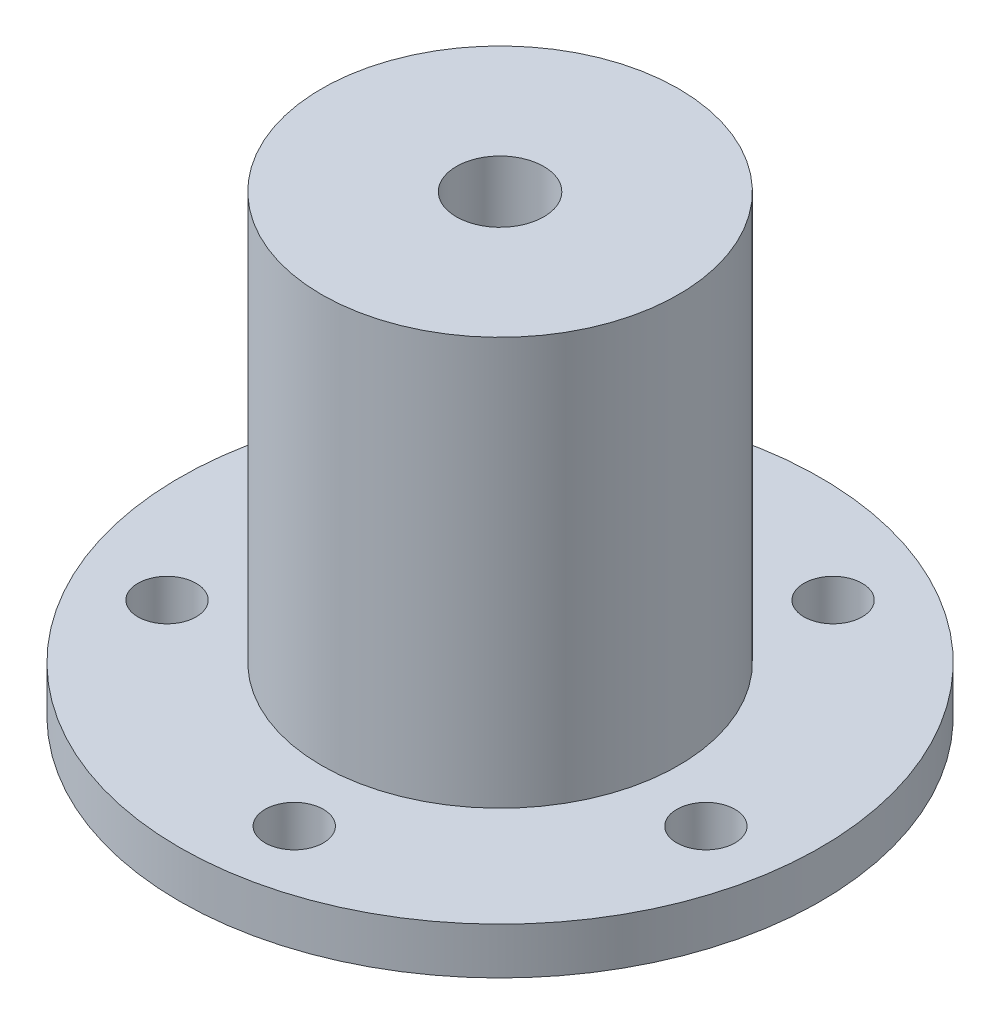
ISO-10303-21;
HEADER;
FILE_DESCRIPTION(('STEP AP214'),'2;1');
FILE_NAME('part.step','',(''),(''),'','','');
FILE_SCHEMA(('AUTOMOTIVE_DESIGN { 1 0 10303 214 1 1 1 1 }'));
ENDSEC;
DATA;
#1=APPLICATION_CONTEXT('core data for automotive mechanical design processes');
#2=APPLICATION_PROTOCOL_DEFINITION('international standard','automotive_design',2000,#1);
#3=PRODUCT_CONTEXT('',#1,'mechanical');
#4=PRODUCT('Part','Part','',(#3));
#5=PRODUCT_RELATED_PRODUCT_CATEGORY('part','',(#4));
#6=PRODUCT_DEFINITION_FORMATION('','',#4);
#7=PRODUCT_DEFINITION_CONTEXT('part definition',#1,'design');
#8=PRODUCT_DEFINITION('design','',#6,#7);
#9=PRODUCT_DEFINITION_SHAPE('','',#8);
#10=(LENGTH_UNIT() NAMED_UNIT(*) SI_UNIT(.MILLI.,.METRE.));
#11=(NAMED_UNIT(*) PLANE_ANGLE_UNIT() SI_UNIT($,.RADIAN.));
#12=(NAMED_UNIT(*) SI_UNIT($,.STERADIAN.) SOLID_ANGLE_UNIT());
#13=UNCERTAINTY_MEASURE_WITH_UNIT(LENGTH_MEASURE(1.E-05),#10,'distance_accuracy_value','');
#14=(GEOMETRIC_REPRESENTATION_CONTEXT(3) GLOBAL_UNCERTAINTY_ASSIGNED_CONTEXT((#13)) GLOBAL_UNIT_ASSIGNED_CONTEXT((#10,
#11,#12)) REPRESENTATION_CONTEXT('',''));
#15=CARTESIAN_POINT('',(0.,0.,0.));
#16=DIRECTION('',(0.,0.,1.));
#17=DIRECTION('',(1.,0.,0.));
#18=AXIS2_PLACEMENT_3D('',#15,#16,#17);
#19=CARTESIAN_POINT('',(0.,1.6,0.));
#20=DIRECTION('',(0.,-1.,0.));
#21=DIRECTION('',(0.,0.,-1.));
#22=AXIS2_PLACEMENT_3D('',#19,#20,#21);
#23=CYLINDRICAL_SURFACE('',#22,11.);
#24=CARTESIAN_POINT('',(0.,1.6,0.));
#25=DIRECTION('',(0.,1.,0.));
#26=DIRECTION('',(0.,0.,1.));
#27=AXIS2_PLACEMENT_3D('',#24,#25,#26);
#28=CIRCLE('',#27,11.);
#29=CARTESIAN_POINT('',(0.,1.6,11.));
#30=VERTEX_POINT('',#29);
#31=EDGE_CURVE('E82',#30,#30,#28,.T.);
#32=ORIENTED_EDGE('',*,*,#31,.F.);
#33=EDGE_LOOP('',(#32));
#34=FACE_BOUND('',#33,.T.);
#35=CARTESIAN_POINT('',(0.,0.,0.));
#36=DIRECTION('',(0.,1.,0.));
#37=DIRECTION('',(0.,0.,1.));
#38=AXIS2_PLACEMENT_3D('',#35,#36,#37);
#39=CIRCLE('',#38,11.);
#40=CARTESIAN_POINT('',(0.,0.,11.));
#41=VERTEX_POINT('',#40);
#42=EDGE_CURVE('E79',#41,#41,#39,.T.);
#43=ORIENTED_EDGE('',*,*,#42,.T.);
#44=EDGE_LOOP('',(#43));
#45=FACE_BOUND('',#44,.T.);
#46=ADVANCED_FACE('F38',(#34,#45),#23,.T.);
#47=CARTESIAN_POINT('',(0.,1.6,0.));
#48=DIRECTION('',(0.,1.,0.));
#49=DIRECTION('',(0.,0.,1.));
#50=AXIS2_PLACEMENT_3D('',#47,#48,#49);
#51=PLANE('',#50);
#52=CARTESIAN_POINT('',(3.85891924778608,1.6,-7.57355545560116));
#53=DIRECTION('',(0.,1.,0.));
#54=DIRECTION('',(0.,0.,1.));
#55=AXIS2_PLACEMENT_3D('',#52,#53,#54);
#56=CIRCLE('',#55,1.);
#57=CARTESIAN_POINT('',(3.85891924778608,1.6,-6.57355545560116));
#58=VERTEX_POINT('',#57);
#59=EDGE_CURVE('E230',#58,#58,#56,.F.);
#60=ORIENTED_EDGE('',*,*,#59,.T.);
#61=EDGE_LOOP('',(#60));
#62=FACE_BOUND('',#61,.T.);
#63=CARTESIAN_POINT('',(8.39535089505868,1.6,1.32969295284189));
#64=DIRECTION('',(0.,1.,0.));
#65=DIRECTION('',(0.,0.,1.));
#66=AXIS2_PLACEMENT_3D('',#63,#64,#65);
#67=CIRCLE('',#66,1.);
#68=CARTESIAN_POINT('',(8.39535089505868,1.6,2.32969295284189));
#69=VERTEX_POINT('',#68);
#70=EDGE_CURVE('E224',#69,#69,#67,.F.);
#71=ORIENTED_EDGE('',*,*,#70,.T.);
#72=EDGE_LOOP('',(#71));
#73=FACE_BOUND('',#72,.T.);
#74=CARTESIAN_POINT('',(1.32969295284204,1.6,8.39535089505866));
#75=DIRECTION('',(0.,1.,0.));
#76=DIRECTION('',(0.,0.,1.));
#77=AXIS2_PLACEMENT_3D('',#74,#75,#76);
#78=CIRCLE('',#77,1.);
#79=CARTESIAN_POINT('',(1.32969295284204,1.6,9.39535089505866));
#80=VERTEX_POINT('',#79);
#81=EDGE_CURVE('E218',#80,#80,#78,.F.);
#82=ORIENTED_EDGE('',*,*,#81,.T.);
#83=EDGE_LOOP('',(#82));
#84=FACE_BOUND('',#83,.T.);
#85=CARTESIAN_POINT('',(-7.57355545560109,1.6,3.85891924778622));
#86=DIRECTION('',(0.,1.,0.));
#87=DIRECTION('',(0.,0.,1.));
#88=AXIS2_PLACEMENT_3D('',#85,#86,#87);
#89=CIRCLE('',#88,1.);
#90=CARTESIAN_POINT('',(-7.57355545560109,1.6,4.85891924778622));
#91=VERTEX_POINT('',#90);
#92=EDGE_CURVE('E217',#91,#91,#89,.F.);
#93=ORIENTED_EDGE('',*,*,#92,.T.);
#94=EDGE_LOOP('',(#93));
#95=FACE_BOUND('',#94,.T.);
#96=CARTESIAN_POINT('',(-6.01040764008571,1.6,-6.0104076400856));
#97=DIRECTION('',(0.,1.,0.));
#98=DIRECTION('',(0.,0.,1.));
#99=AXIS2_PLACEMENT_3D('',#96,#97,#98);
#100=CIRCLE('',#99,1.);
#101=CARTESIAN_POINT('',(-6.01040764008571,1.6,-5.0104076400856));
#102=VERTEX_POINT('',#101);
#103=EDGE_CURVE('E69',#102,#102,#100,.F.);
#104=ORIENTED_EDGE('',*,*,#103,.T.);
#105=EDGE_LOOP('',(#104));
#106=FACE_BOUND('',#105,.T.);
#107=CARTESIAN_POINT('',(0.,1.6,0.));
#108=DIRECTION('',(0.,1.,0.));
#109=DIRECTION('',(0.,0.,1.));
#110=AXIS2_PLACEMENT_3D('',#107,#108,#109);
#111=CIRCLE('',#110,6.125);
#112=CARTESIAN_POINT('',(0.,1.6,6.125));
#113=VERTEX_POINT('',#112);
#114=EDGE_CURVE('E54',#113,#113,#111,.T.);
#115=ORIENTED_EDGE('',*,*,#114,.F.);
#116=EDGE_LOOP('',(#115));
#117=FACE_BOUND('',#116,.T.);
#118=ORIENTED_EDGE('',*,*,#31,.T.);
#119=EDGE_LOOP('',(#118));
#120=FACE_BOUND('',#119,.T.);
#121=ADVANCED_FACE('F92',(#62,#73,#84,#95,#106,#117,#120),#51,.T.);
#122=CARTESIAN_POINT('',(0.,0.,0.));
#123=DIRECTION('',(0.,1.,0.));
#124=DIRECTION('',(0.,0.,1.));
#125=AXIS2_PLACEMENT_3D('',#122,#123,#124);
#126=PLANE('',#125);
#127=CARTESIAN_POINT('',(3.85891924778608,0.,-7.57355545560116));
#128=DIRECTION('',(0.,-1.,0.));
#129=DIRECTION('',(0.,0.,-1.));
#130=AXIS2_PLACEMENT_3D('',#127,#128,#129);
#131=CIRCLE('',#130,1.);
#132=CARTESIAN_POINT('',(3.85891924778608,0.,-8.57355545560116));
#133=VERTEX_POINT('',#132);
#134=EDGE_CURVE('E204',#133,#133,#131,.T.);
#135=ORIENTED_EDGE('',*,*,#134,.F.);
#136=EDGE_LOOP('',(#135));
#137=FACE_BOUND('',#136,.T.);
#138=CARTESIAN_POINT('',(8.39535089505868,0.,1.32969295284189));
#139=DIRECTION('',(0.,-1.,0.));
#140=DIRECTION('',(0.,0.,-1.));
#141=AXIS2_PLACEMENT_3D('',#138,#139,#140);
#142=CIRCLE('',#141,1.);
#143=CARTESIAN_POINT('',(8.39535089505868,0.,0.329692952841886));
#144=VERTEX_POINT('',#143);
#145=EDGE_CURVE('E227',#144,#144,#142,.T.);
#146=ORIENTED_EDGE('',*,*,#145,.F.);
#147=EDGE_LOOP('',(#146));
#148=FACE_BOUND('',#147,.T.);
#149=CARTESIAN_POINT('',(1.32969295284204,0.,8.39535089505866));
#150=DIRECTION('',(0.,-1.,0.));
#151=DIRECTION('',(0.,0.,-1.));
#152=AXIS2_PLACEMENT_3D('',#149,#150,#151);
#153=CIRCLE('',#152,1.);
#154=CARTESIAN_POINT('',(1.32969295284204,0.,7.39535089505866));
#155=VERTEX_POINT('',#154);
#156=EDGE_CURVE('E221',#155,#155,#153,.T.);
#157=ORIENTED_EDGE('',*,*,#156,.F.);
#158=EDGE_LOOP('',(#157));
#159=FACE_BOUND('',#158,.T.);
#160=CARTESIAN_POINT('',(-7.57355545560109,0.,3.85891924778622));
#161=DIRECTION('',(0.,-1.,0.));
#162=DIRECTION('',(0.,0.,-1.));
#163=AXIS2_PLACEMENT_3D('',#160,#161,#162);
#164=CIRCLE('',#163,1.);
#165=CARTESIAN_POINT('',(-7.57355545560109,0.,2.85891924778622));
#166=VERTEX_POINT('',#165);
#167=EDGE_CURVE('E205',#166,#166,#164,.T.);
#168=ORIENTED_EDGE('',*,*,#167,.F.);
#169=EDGE_LOOP('',(#168));
#170=FACE_BOUND('',#169,.T.);
#171=CARTESIAN_POINT('',(-6.01040764008571,0.,-6.0104076400856));
#172=DIRECTION('',(0.,-1.,0.));
#173=DIRECTION('',(0.,0.,-1.));
#174=AXIS2_PLACEMENT_3D('',#171,#172,#173);
#175=CIRCLE('',#174,1.);
#176=CARTESIAN_POINT('',(-6.01040764008571,0.,-7.0104076400856));
#177=VERTEX_POINT('',#176);
#178=EDGE_CURVE('E74',#177,#177,#175,.T.);
#179=ORIENTED_EDGE('',*,*,#178,.F.);
#180=EDGE_LOOP('',(#179));
#181=FACE_BOUND('',#180,.T.);
#182=CARTESIAN_POINT('',(0.,0.,0.));
#183=DIRECTION('',(0.,1.,0.));
#184=DIRECTION('',(0.,0.,1.));
#185=AXIS2_PLACEMENT_3D('',#182,#183,#184);
#186=CIRCLE('',#185,1.5);
#187=CARTESIAN_POINT('',(0.,0.,1.5));
#188=VERTEX_POINT('',#187);
#189=EDGE_CURVE('E64',#188,#188,#186,.T.);
#190=ORIENTED_EDGE('',*,*,#189,.T.);
#191=EDGE_LOOP('',(#190));
#192=FACE_BOUND('',#191,.T.);
#193=ORIENTED_EDGE('',*,*,#42,.F.);
#194=EDGE_LOOP('',(#193));
#195=FACE_BOUND('',#194,.T.);
#196=ADVANCED_FACE('F89',(#137,#148,#159,#170,#181,#192,#195),#126,.F.);
#197=CARTESIAN_POINT('',(0.,15.6,0.));
#198=DIRECTION('',(0.,-1.,0.));
#199=DIRECTION('',(0.,0.,-1.));
#200=AXIS2_PLACEMENT_3D('',#197,#198,#199);
#201=CYLINDRICAL_SURFACE('',#200,6.125);
#202=CARTESIAN_POINT('',(0.,12.1,-6.125));
#203=CARTESIAN_POINT('',(-0.0829306005824024,12.0999975764613,-6.12499856396247));
#204=CARTESIAN_POINT('',(-0.165888626107481,12.0930993615078,-6.12329887898551));
#205=CARTESIAN_POINT('',(-0.329430714252231,12.0657278993208,-6.11668309677731));
#206=CARTESIAN_POINT('',(-0.410013341825552,12.045246614867,-6.1117650952631));
#207=CARTESIAN_POINT('',(-0.566419015525031,11.9914027926989,-6.09925778784529));
#208=CARTESIAN_POINT('',(-0.642247530418136,11.9580553834099,-6.09167162018446));
#209=CARTESIAN_POINT('',(-0.787233558664146,11.8794782781923,-6.07463775516129));
#210=CARTESIAN_POINT('',(-0.85639091333032,11.8342482997086,-6.06519001353398));
#211=CARTESIAN_POINT('',(-0.987442801407419,11.7322426390357,-6.04525088671361));
#212=CARTESIAN_POINT('',(-1.04918624015421,11.6752758714347,-6.0347439250254));
#213=CARTESIAN_POINT('',(-1.16234492716674,11.5518230151991,-6.01397508985644));
#214=CARTESIAN_POINT('',(-1.21375905443416,11.4853358946988,-6.00371324308339));
#215=CARTESIAN_POINT('',(-1.30550267891219,11.3435660914855,-5.9844401162813));
#216=CARTESIAN_POINT('',(-1.34566456100555,11.2681720029365,-5.97544864459751));
#217=CARTESIAN_POINT('',(-1.4126862213248,11.111446987456,-5.95996089889054));
#218=CARTESIAN_POINT('',(-1.43954803211376,11.030116969855,-5.95346424363494));
#219=CARTESIAN_POINT('',(-1.47869433779495,10.8654865027247,-5.94386156797189));
#220=CARTESIAN_POINT('',(-1.49124981321253,10.782254242901,-5.94069261078362));
#221=CARTESIAN_POINT('',(-1.50227086513698,10.6148090692434,-5.93791564028692));
#222=CARTESIAN_POINT('',(-1.50073863575971,10.5305963101595,-5.93830707245891));
#223=CARTESIAN_POINT('',(-1.48384429410747,10.3656465344104,-5.9425500091736));
#224=CARTESIAN_POINT('',(-1.46880366084462,10.2848742010339,-5.94632107914021));
#225=CARTESIAN_POINT('',(-1.42583168565202,10.1270355687205,-5.95677037744899));
#226=CARTESIAN_POINT('',(-1.39789945852544,10.0499695246759,-5.9634488054221));
#227=CARTESIAN_POINT('',(-1.32965963627587,9.90086193757087,-5.97903508081306));
#228=CARTESIAN_POINT('',(-1.28923418805927,9.82887662594933,-5.98796400333177));
#229=CARTESIAN_POINT('',(-1.19723794707047,9.69259535163802,-6.00703313387521));
#230=CARTESIAN_POINT('',(-1.14566527682664,9.62830068708312,-6.0171735458163));
#231=CARTESIAN_POINT('',(-1.03116703829527,9.50738198315466,-6.03786287547061));
#232=CARTESIAN_POINT('',(-0.967969810710724,9.45101548194737,-6.04841538508906));
#233=CARTESIAN_POINT('',(-0.832894308059626,9.34963285026216,-6.06848968290004));
#234=CARTESIAN_POINT('',(-0.761015788564495,9.30461703948205,-6.07801144205666));
#235=CARTESIAN_POINT('',(-0.610259770448615,9.22712446428253,-6.09499571936318));
#236=CARTESIAN_POINT('',(-0.531360686635111,9.19468813768492,-6.10245157491609));
#237=CARTESIAN_POINT('',(-0.369006832957924,9.14360986336245,-6.11441538573556));
#238=CARTESIAN_POINT('',(-0.285552901353999,9.12496538655956,-6.11892388145608));
#239=CARTESIAN_POINT('',(-0.118661422947513,9.10239014386932,-6.12440553014033));
#240=CARTESIAN_POINT('',(-0.0352740408282093,9.09810848516009,-6.1254629766344));
#241=CARTESIAN_POINT('',(0.131025466072572,9.10341996007035,-6.12416279988687));
#242=CARTESIAN_POINT('',(0.21393763117905,9.11301189839418,-6.12180547084915));
#243=CARTESIAN_POINT('',(0.375723525677185,9.14550870463527,-6.11399449797241));
#244=CARTESIAN_POINT('',(0.454637781212646,9.16822340921458,-6.10858510751231));
#245=CARTESIAN_POINT('',(0.607532568804245,9.22610480885644,-6.09527879494356));
#246=CARTESIAN_POINT('',(0.681512613687506,9.26127273131487,-6.08738162764675));
#247=CARTESIAN_POINT('',(0.823844536204184,9.34375100156103,-6.06977270746887));
#248=CARTESIAN_POINT('',(0.892077915590571,9.39125953743443,-6.0600321163636));
#249=CARTESIAN_POINT('',(1.01972870259778,9.49681584109431,-6.0398643897347));
#250=CARTESIAN_POINT('',(1.07914465062184,9.55486535025611,-6.02943714095647));
#251=CARTESIAN_POINT('',(1.18891012127041,9.68148211906465,-6.00876993226737));
#252=CARTESIAN_POINT('',(1.23901398493305,9.7502643470879,-5.99854011984379));
#253=CARTESIAN_POINT('',(1.32696627492766,9.89546884630378,-5.97970037322189));
#254=CARTESIAN_POINT('',(1.36481524892507,9.9718907758818,-5.97109036664238));
#255=CARTESIAN_POINT('',(1.42690428657667,10.1297912761734,-5.9565582695881));
#256=CARTESIAN_POINT('',(1.45122492211072,10.2112366282115,-5.9506203063713));
#257=CARTESIAN_POINT('',(1.48578428107045,10.3772268301115,-5.94208657507043));
#258=CARTESIAN_POINT('',(1.49602593664092,10.461771030828,-5.93949011107953));
#259=CARTESIAN_POINT('',(1.50198811424395,10.6290634108868,-5.93798486677975));
#260=CARTESIAN_POINT('',(1.49810067995139,10.7117969505765,-5.9389765224894));
#261=CARTESIAN_POINT('',(1.47680871156497,10.8753904876045,-5.94430644710493));
#262=CARTESIAN_POINT('',(1.45940442818799,10.9562505196651,-5.9486446539374));
#263=CARTESIAN_POINT('',(1.41178287902866,11.1133951720956,-5.96012453242491));
#264=CARTESIAN_POINT('',(1.38163633029805,11.1897024315756,-5.96725071536384));
#265=CARTESIAN_POINT('',(1.30944246656108,11.3362292822357,-5.98350637003248));
#266=CARTESIAN_POINT('',(1.26739356784856,11.4064480616678,-5.99263610831544));
#267=CARTESIAN_POINT('',(1.1713473780251,11.5407058446536,-6.01215642384141));
#268=CARTESIAN_POINT('',(1.11707676430904,11.6045455868815,-6.02257288890672));
#269=CARTESIAN_POINT('',(0.998664056170338,11.722339642997,-6.04333531467797));
#270=CARTESIAN_POINT('',(0.934519634758436,11.7762916200229,-6.0536812581621));
#271=CARTESIAN_POINT('',(0.796849803860762,11.873680201329,-6.07334892532539));
#272=CARTESIAN_POINT('',(0.723182127344935,11.9169201687889,-6.08264999273487));
#273=CARTESIAN_POINT('',(0.569403677436991,11.990333412031,-6.09896410275037));
#274=CARTESIAN_POINT('',(0.489297711317414,12.0205163315826,-6.10597883306842));
#275=CARTESIAN_POINT('',(0.341077617218871,12.0623213967703,-6.11585536270174));
#276=CARTESIAN_POINT('',(0.273687633179682,12.0764209728418,-6.11926145545373));
#277=CARTESIAN_POINT('',(0.137537990578478,12.0952609560439,-6.12383429221373));
#278=CARTESIAN_POINT('',(0.0687784270025174,12.1000020099599,-6.12500119097657));
#279=CARTESIAN_POINT('',(0.,12.1,-6.125));
#280=B_SPLINE_CURVE_WITH_KNOTS('',3,(#202,#203,#204,#205,#206,#207,#208,#209,#210,#211,#212,
#213,#214,#215,#216,#217,#218,#219,#220,#221,#222,#223,#224,#225,#226,#227,#228,#229,#230,#231,
#232,#233,#234,#235,#236,#237,#238,#239,#240,#241,#242,#243,#244,#245,#246,#247,#248,#249,#250,
#251,#252,#253,#254,#255,#256,#257,#258,#259,#260,#261,#262,#263,#264,#265,#266,#267,#268,#269,
#270,#271,#272,#273,#274,#275,#276,#277,#278,#279),.UNSPECIFIED.,.T.,.F.,(4,2,2,2,2,2,2,2,2,2,2,
2,2,2,2,2,2,2,2,2,2,2,2,2,2,2,2,2,2,2,2,2,2,2,2,2,2,2,4),(0.,0.248539805580581,
0.497226805690062,0.745622278011369,0.99402365745361,1.24684414523,1.4996920557854,
1.7561273071029,2.01252335698966,2.2639777022238,2.5153928848956,2.76097883408564,
3.00658164885924,3.25457594736904,3.50261204692768,3.75742423280012,4.01224359478255,
4.26787543673348,4.52346039061219,4.77275390811273,5.0220259487237,5.26777326973997,
5.51354481848975,5.76353784842012,6.01357221498898,6.26947786641102,6.52537207994678,
6.779725462043,7.03402586345486,7.28132466371463,7.52861887706908,7.77455831273061,
8.02053048806433,8.27267429434196,8.52487761532813,8.78141498542412,9.03776255543657,
9.24390309089214,9.45002937908124),.UNSPECIFIED.);
#281=CARTESIAN_POINT('',(0.,12.1,-6.125));
#282=VERTEX_POINT('',#281);
#283=EDGE_CURVE('E198',#282,#282,#280,.T.);
#284=ORIENTED_EDGE('',*,*,#283,.T.);
#285=EDGE_LOOP('',(#284));
#286=FACE_BOUND('',#285,.T.);
#287=CARTESIAN_POINT('',(0.,15.6,0.));
#288=DIRECTION('',(0.,1.,0.));
#289=DIRECTION('',(0.,0.,1.));
#290=AXIS2_PLACEMENT_3D('',#287,#288,#289);
#291=CIRCLE('',#290,6.125);
#292=CARTESIAN_POINT('',(0.,15.6,6.125));
#293=VERTEX_POINT('',#292);
#294=EDGE_CURVE('E71',#293,#293,#291,.T.);
#295=ORIENTED_EDGE('',*,*,#294,.F.);
#296=EDGE_LOOP('',(#295));
#297=FACE_BOUND('',#296,.T.);
#298=ORIENTED_EDGE('',*,*,#114,.T.);
#299=EDGE_LOOP('',(#298));
#300=FACE_BOUND('',#299,.T.);
#301=ADVANCED_FACE('F91',(#286,#297,#300),#201,.T.);
#302=CARTESIAN_POINT('',(0.,15.6,0.));
#303=DIRECTION('',(0.,1.,0.));
#304=DIRECTION('',(0.,0.,1.));
#305=AXIS2_PLACEMENT_3D('',#302,#303,#304);
#306=PLANE('',#305);
#307=CARTESIAN_POINT('',(0.,15.6,0.));
#308=DIRECTION('',(0.,1.,0.));
#309=DIRECTION('',(0.,0.,1.));
#310=AXIS2_PLACEMENT_3D('',#307,#308,#309);
#311=CIRCLE('',#310,1.5);
#312=CARTESIAN_POINT('',(0.,15.6,1.5));
#313=VERTEX_POINT('',#312);
#314=EDGE_CURVE('E67',#313,#313,#311,.T.);
#315=ORIENTED_EDGE('',*,*,#314,.F.);
#316=EDGE_LOOP('',(#315));
#317=FACE_BOUND('',#316,.T.);
#318=ORIENTED_EDGE('',*,*,#294,.T.);
#319=EDGE_LOOP('',(#318));
#320=FACE_BOUND('',#319,.T.);
#321=ADVANCED_FACE('F59',(#317,#320),#306,.T.);
#322=CARTESIAN_POINT('',(0.,0.,0.));
#323=DIRECTION('',(0.,1.,0.));
#324=DIRECTION('',(0.,0.,1.));
#325=AXIS2_PLACEMENT_3D('',#322,#323,#324);
#326=CYLINDRICAL_SURFACE('',#325,1.5);
#327=CARTESIAN_POINT('',(0.,10.6,0.));
#328=DIRECTION('',(0.,0.707106781186547,-0.707106781186547));
#329=DIRECTION('',(0.,0.707106781186547,0.707106781186547));
#330=AXIS2_PLACEMENT_3D('',#327,#328,#329);
#331=ELLIPSE('',#330,2.12132034355964,1.5);
#332=CARTESIAN_POINT('',(1.5,10.6,0.));
#333=VERTEX_POINT('',#332);
#334=CARTESIAN_POINT('',(-1.5,10.6,0.));
#335=VERTEX_POINT('',#334);
#336=EDGE_CURVE('E45',#333,#335,#331,.T.);
#337=ORIENTED_EDGE('',*,*,#336,.T.);
#338=CARTESIAN_POINT('',(0.,10.6,0.));
#339=DIRECTION('',(0.,0.707106781186547,0.707106781186547));
#340=DIRECTION('',(0.,0.707106781186547,-0.707106781186547));
#341=AXIS2_PLACEMENT_3D('',#338,#339,#340);
#342=ELLIPSE('',#341,2.12132034355964,1.5);
#343=EDGE_CURVE('E11',#335,#333,#342,.F.);
#344=ORIENTED_EDGE('',*,*,#343,.T.);
#345=EDGE_LOOP('',(#337,#344));
#346=FACE_BOUND('',#345,.T.);
#347=ORIENTED_EDGE('',*,*,#189,.F.);
#348=EDGE_LOOP('',(#347));
#349=FACE_BOUND('',#348,.T.);
#350=ORIENTED_EDGE('',*,*,#314,.T.);
#351=EDGE_LOOP('',(#350));
#352=FACE_BOUND('',#351,.T.);
#353=ADVANCED_FACE('F55',(#346,#349,#352),#326,.F.);
#354=CARTESIAN_POINT('',(-6.01040764008571,4.42842712474619,-6.0104076400856));
#355=DIRECTION('',(0.,-1.,0.));
#356=DIRECTION('',(0.,0.,-1.));
#357=AXIS2_PLACEMENT_3D('',#354,#355,#356);
#358=CYLINDRICAL_SURFACE('',#357,1.);
#359=ORIENTED_EDGE('',*,*,#178,.T.);
#360=EDGE_LOOP('',(#359));
#361=FACE_BOUND('',#360,.T.);
#362=ORIENTED_EDGE('',*,*,#103,.F.);
#363=EDGE_LOOP('',(#362));
#364=FACE_BOUND('',#363,.T.);
#365=ADVANCED_FACE('F58',(#361,#364),#358,.F.);
#366=CARTESIAN_POINT('',(-7.57355545560109,4.42842712474619,3.85891924778622));
#367=DIRECTION('',(0.,-1.,0.));
#368=DIRECTION('',(0.,0.,-1.));
#369=AXIS2_PLACEMENT_3D('',#366,#367,#368);
#370=CYLINDRICAL_SURFACE('',#369,1.);
#371=ORIENTED_EDGE('',*,*,#167,.T.);
#372=EDGE_LOOP('',(#371));
#373=FACE_BOUND('',#372,.T.);
#374=ORIENTED_EDGE('',*,*,#92,.F.);
#375=EDGE_LOOP('',(#374));
#376=FACE_BOUND('',#375,.T.);
#377=ADVANCED_FACE('F132',(#373,#376),#370,.F.);
#378=CARTESIAN_POINT('',(1.32969295284204,4.42842712474619,8.39535089505866));
#379=DIRECTION('',(0.,-1.,0.));
#380=DIRECTION('',(0.,0.,-1.));
#381=AXIS2_PLACEMENT_3D('',#378,#379,#380);
#382=CYLINDRICAL_SURFACE('',#381,1.);
#383=ORIENTED_EDGE('',*,*,#156,.T.);
#384=EDGE_LOOP('',(#383));
#385=FACE_BOUND('',#384,.T.);
#386=ORIENTED_EDGE('',*,*,#81,.F.);
#387=EDGE_LOOP('',(#386));
#388=FACE_BOUND('',#387,.T.);
#389=ADVANCED_FACE('F143',(#385,#388),#382,.F.);
#390=CARTESIAN_POINT('',(8.39535089505868,4.42842712474619,1.32969295284189));
#391=DIRECTION('',(0.,-1.,0.));
#392=DIRECTION('',(0.,0.,-1.));
#393=AXIS2_PLACEMENT_3D('',#390,#391,#392);
#394=CYLINDRICAL_SURFACE('',#393,1.);
#395=ORIENTED_EDGE('',*,*,#145,.T.);
#396=EDGE_LOOP('',(#395));
#397=FACE_BOUND('',#396,.T.);
#398=ORIENTED_EDGE('',*,*,#70,.F.);
#399=EDGE_LOOP('',(#398));
#400=FACE_BOUND('',#399,.T.);
#401=ADVANCED_FACE('F153',(#397,#400),#394,.F.);
#402=CARTESIAN_POINT('',(3.85891924778608,4.42842712474619,-7.57355545560116));
#403=DIRECTION('',(0.,-1.,0.));
#404=DIRECTION('',(0.,0.,-1.));
#405=AXIS2_PLACEMENT_3D('',#402,#403,#404);
#406=CYLINDRICAL_SURFACE('',#405,1.);
#407=ORIENTED_EDGE('',*,*,#134,.T.);
#408=EDGE_LOOP('',(#407));
#409=FACE_BOUND('',#408,.T.);
#410=ORIENTED_EDGE('',*,*,#59,.F.);
#411=EDGE_LOOP('',(#410));
#412=FACE_BOUND('',#411,.T.);
#413=ADVANCED_FACE('F163',(#409,#412),#406,.F.);
#414=CARTESIAN_POINT('',(0.,10.6,-10.));
#415=DIRECTION('',(0.,0.,1.));
#416=DIRECTION('',(1.,0.,0.));
#417=AXIS2_PLACEMENT_3D('',#414,#415,#416);
#418=CYLINDRICAL_SURFACE('',#417,1.5);
#419=ORIENTED_EDGE('',*,*,#336,.F.);
#420=ORIENTED_EDGE('',*,*,#343,.F.);
#421=EDGE_LOOP('',(#419,#420));
#422=FACE_BOUND('',#421,.T.);
#423=ORIENTED_EDGE('',*,*,#283,.F.);
#424=EDGE_LOOP('',(#423));
#425=FACE_BOUND('',#424,.T.);
#426=ADVANCED_FACE('F51',(#422,#425),#418,.F.);
#427=CLOSED_SHELL('',(#46,#121,#196,#301,#321,#353,#365,#377,#389,#401,#413,#426));
#428=MANIFOLD_SOLID_BREP('B2',#427);
#429=ADVANCED_BREP_SHAPE_REPRESENTATION('',(#18,#428),#14);
#430=SHAPE_DEFINITION_REPRESENTATION(#9,#429);
ENDSEC;
END-ISO-10303-21;
